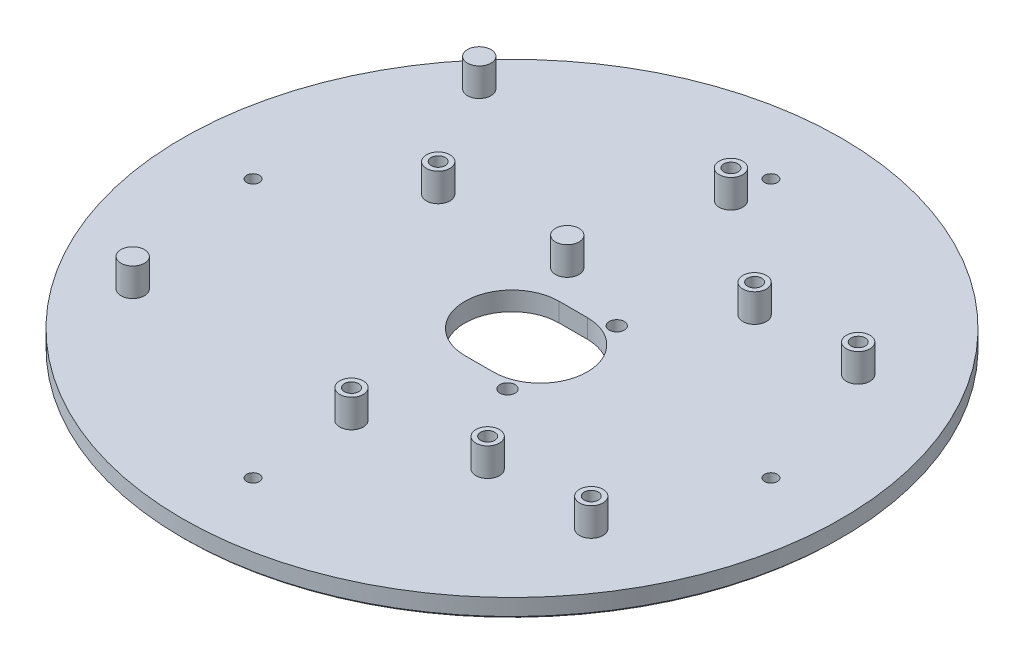
ISO-10303-21;
HEADER;
FILE_DESCRIPTION(('STEP AP214'),'2;1');
FILE_NAME('part.step','',(''),(''),'','','');
FILE_SCHEMA(('AUTOMOTIVE_DESIGN { 1 0 10303 214 1 1 1 1 }'));
ENDSEC;
DATA;
#1=APPLICATION_CONTEXT('core data for automotive mechanical design processes');
#2=APPLICATION_PROTOCOL_DEFINITION('international standard','automotive_design',2000,#1);
#3=PRODUCT_CONTEXT('',#1,'mechanical');
#4=PRODUCT('Part','Part','',(#3));
#5=PRODUCT_RELATED_PRODUCT_CATEGORY('part','',(#4));
#6=PRODUCT_DEFINITION_FORMATION('','',#4);
#7=PRODUCT_DEFINITION_CONTEXT('part definition',#1,'design');
#8=PRODUCT_DEFINITION('design','',#6,#7);
#9=PRODUCT_DEFINITION_SHAPE('','',#8);
#10=(LENGTH_UNIT() NAMED_UNIT(*) SI_UNIT(.MILLI.,.METRE.));
#11=(NAMED_UNIT(*) PLANE_ANGLE_UNIT() SI_UNIT($,.RADIAN.));
#12=(NAMED_UNIT(*) SI_UNIT($,.STERADIAN.) SOLID_ANGLE_UNIT());
#13=UNCERTAINTY_MEASURE_WITH_UNIT(LENGTH_MEASURE(1.E-05),#10,'distance_accuracy_value','');
#14=(GEOMETRIC_REPRESENTATION_CONTEXT(3) GLOBAL_UNCERTAINTY_ASSIGNED_CONTEXT((#13)) GLOBAL_UNIT_ASSIGNED_CONTEXT((#10,
#11,#12)) REPRESENTATION_CONTEXT('',''));
#15=CARTESIAN_POINT('',(0.,0.,0.));
#16=DIRECTION('',(0.,0.,1.));
#17=DIRECTION('',(1.,0.,0.));
#18=AXIS2_PLACEMENT_3D('',#15,#16,#17);
#19=CARTESIAN_POINT('',(0.,4.,0.));
#20=DIRECTION('',(0.,-1.,0.));
#21=DIRECTION('',(0.,0.,-1.));
#22=AXIS2_PLACEMENT_3D('',#19,#20,#21);
#23=CYLINDRICAL_SURFACE('',#22,70.);
#24=CARTESIAN_POINT('',(0.,0.499999999999973,0.));
#25=DIRECTION('',(0.,1.,0.));
#26=DIRECTION('',(0.,0.,1.));
#27=AXIS2_PLACEMENT_3D('',#24,#25,#26);
#28=CIRCLE('',#27,70.);
#29=CARTESIAN_POINT('',(0.,0.499999999999973,70.));
#30=VERTEX_POINT('',#29);
#31=EDGE_CURVE('E54',#30,#30,#28,.T.);
#32=ORIENTED_EDGE('',*,*,#31,.T.);
#33=EDGE_LOOP('',(#32));
#34=FACE_BOUND('',#33,.T.);
#35=CARTESIAN_POINT('',(0.,4.,0.));
#36=DIRECTION('',(0.,1.,0.));
#37=DIRECTION('',(0.,0.,1.));
#38=AXIS2_PLACEMENT_3D('',#35,#36,#37);
#39=CIRCLE('',#38,70.);
#40=CARTESIAN_POINT('',(0.,4.,70.));
#41=VERTEX_POINT('',#40);
#42=EDGE_CURVE('E93',#41,#41,#39,.T.);
#43=ORIENTED_EDGE('',*,*,#42,.F.);
#44=EDGE_LOOP('',(#43));
#45=FACE_BOUND('',#44,.T.);
#46=ADVANCED_FACE('F46',(#34,#45),#23,.T.);
#47=CARTESIAN_POINT('',(0.,4.,0.));
#48=DIRECTION('',(0.,1.,0.));
#49=DIRECTION('',(0.,0.,1.));
#50=AXIS2_PLACEMENT_3D('',#47,#48,#49);
#51=PLANE('',#50);
#52=CARTESIAN_POINT('',(10.6441872975892,4.,11.6052369361815));
#53=DIRECTION('',(0.,-1.,0.));
#54=DIRECTION('',(0.,0.,-1.));
#55=AXIS2_PLACEMENT_3D('',#52,#53,#54);
#56=CIRCLE('',#55,1.6);
#57=CARTESIAN_POINT('',(10.6441872975892,4.,10.0052369361815));
#58=VERTEX_POINT('',#57);
#59=EDGE_CURVE('E727',#58,#58,#56,.T.);
#60=ORIENTED_EDGE('',*,*,#59,.T.);
#61=EDGE_LOOP('',(#60));
#62=FACE_BOUND('',#61,.T.);
#63=CARTESIAN_POINT('',(10.6441872975892,4.,-11.6052369361815));
#64=DIRECTION('',(0.,-1.,0.));
#65=DIRECTION('',(0.,0.,-1.));
#66=AXIS2_PLACEMENT_3D('',#63,#64,#65);
#67=CIRCLE('',#66,1.6);
#68=CARTESIAN_POINT('',(10.6441872975892,4.,-13.2052369361815));
#69=VERTEX_POINT('',#68);
#70=EDGE_CURVE('E710',#69,#69,#67,.T.);
#71=ORIENTED_EDGE('',*,*,#70,.T.);
#72=EDGE_LOOP('',(#71));
#73=FACE_BOUND('',#72,.T.);
#74=CARTESIAN_POINT('',(55.,4.,0.));
#75=DIRECTION('',(0.,1.,0.));
#76=DIRECTION('',(0.,0.,1.));
#77=AXIS2_PLACEMENT_3D('',#74,#75,#76);
#78=CIRCLE('',#77,1.35);
#79=CARTESIAN_POINT('',(55.,4.,1.35));
#80=VERTEX_POINT('',#79);
#81=EDGE_CURVE('E719',#80,#80,#78,.F.);
#82=ORIENTED_EDGE('',*,*,#81,.T.);
#83=EDGE_LOOP('',(#82));
#84=FACE_BOUND('',#83,.T.);
#85=CARTESIAN_POINT('',(0.,4.,-55.));
#86=DIRECTION('',(0.,1.,0.));
#87=DIRECTION('',(0.,0.,1.));
#88=AXIS2_PLACEMENT_3D('',#85,#86,#87);
#89=CIRCLE('',#88,1.35);
#90=CARTESIAN_POINT('',(0.,4.,-53.65));
#91=VERTEX_POINT('',#90);
#92=EDGE_CURVE('E713',#91,#91,#89,.F.);
#93=ORIENTED_EDGE('',*,*,#92,.T.);
#94=EDGE_LOOP('',(#93));
#95=FACE_BOUND('',#94,.T.);
#96=CARTESIAN_POINT('',(0.,4.,55.));
#97=DIRECTION('',(0.,1.,0.));
#98=DIRECTION('',(0.,0.,1.));
#99=AXIS2_PLACEMENT_3D('',#96,#97,#98);
#100=CIRCLE('',#99,1.35);
#101=CARTESIAN_POINT('',(0.,4.,56.35));
#102=VERTEX_POINT('',#101);
#103=EDGE_CURVE('E706',#102,#102,#100,.F.);
#104=ORIENTED_EDGE('',*,*,#103,.T.);
#105=EDGE_LOOP('',(#104));
#106=FACE_BOUND('',#105,.T.);
#107=CARTESIAN_POINT('',(-55.,4.,0.));
#108=DIRECTION('',(0.,1.,0.));
#109=DIRECTION('',(0.,0.,1.));
#110=AXIS2_PLACEMENT_3D('',#107,#108,#109);
#111=CIRCLE('',#110,1.35);
#112=CARTESIAN_POINT('',(-55.,4.,1.35));
#113=VERTEX_POINT('',#112);
#114=EDGE_CURVE('E700',#113,#113,#111,.F.);
#115=ORIENTED_EDGE('',*,*,#114,.T.);
#116=EDGE_LOOP('',(#115));
#117=FACE_BOUND('',#116,.T.);
#118=CARTESIAN_POINT('',(-47.5339886149693,4.,33.0275201405061));
#119=DIRECTION('',(0.,1.,0.));
#120=DIRECTION('',(0.,0.,1.));
#121=AXIS2_PLACEMENT_3D('',#118,#119,#120);
#122=CIRCLE('',#121,2.5);
#123=CARTESIAN_POINT('',(-47.5339886149693,4.,35.5275201405061));
#124=VERTEX_POINT('',#123);
#125=EDGE_CURVE('E125',#124,#124,#122,.T.);
#126=ORIENTED_EDGE('',*,*,#125,.F.);
#127=EDGE_LOOP('',(#126));
#128=FACE_BOUND('',#127,.T.);
#129=CARTESIAN_POINT('',(-5.29337774476633,4.,-17.0303035725372));
#130=DIRECTION('',(0.,1.,0.));
#131=DIRECTION('',(0.,0.,1.));
#132=AXIS2_PLACEMENT_3D('',#129,#130,#131);
#133=CIRCLE('',#132,2.5);
#134=CARTESIAN_POINT('',(-5.29337774476633,4.,-14.5303035725372));
#135=VERTEX_POINT('',#134);
#136=EDGE_CURVE('E129',#135,#135,#133,.T.);
#137=ORIENTED_EDGE('',*,*,#136,.F.);
#138=EDGE_LOOP('',(#137));
#139=FACE_BOUND('',#138,.T.);
#140=CARTESIAN_POINT('',(-47.5339886149701,4.,-40.5718419580567));
#141=DIRECTION('',(0.,1.,0.));
#142=DIRECTION('',(0.,0.,1.));
#143=AXIS2_PLACEMENT_3D('',#140,#141,#142);
#144=CIRCLE('',#143,2.5);
#145=CARTESIAN_POINT('',(-47.5339886149701,4.,-38.0718419580567));
#146=VERTEX_POINT('',#145);
#147=EDGE_CURVE('E134',#146,#146,#144,.T.);
#148=ORIENTED_EDGE('',*,*,#147,.F.);
#149=EDGE_LOOP('',(#148));
#150=FACE_BOUND('',#149,.T.);
#151=CARTESIAN_POINT('',(-0.1529925208913,4.,33.9401713357412));
#152=DIRECTION('',(0.,1.,0.));
#153=DIRECTION('',(0.,0.,1.));
#154=AXIS2_PLACEMENT_3D('',#151,#152,#153);
#155=CIRCLE('',#154,2.5);
#156=CARTESIAN_POINT('',(-0.1529925208913,4.,36.4401713357412));
#157=VERTEX_POINT('',#156);
#158=EDGE_CURVE('E149',#157,#157,#155,.T.);
#159=ORIENTED_EDGE('',*,*,#158,.F.);
#160=EDGE_LOOP('',(#159));
#161=FACE_BOUND('',#160,.T.);
#162=CARTESIAN_POINT('',(23.2606500317656,4.,28.4285469058722));
#163=DIRECTION('',(0.,1.,0.));
#164=DIRECTION('',(0.,0.,1.));
#165=AXIS2_PLACEMENT_3D('',#162,#163,#164);
#166=CIRCLE('',#165,2.5);
#167=CARTESIAN_POINT('',(23.2606500317656,4.,30.9285469058722));
#168=VERTEX_POINT('',#167);
#169=EDGE_CURVE('E158',#168,#168,#166,.T.);
#170=ORIENTED_EDGE('',*,*,#169,.F.);
#171=EDGE_LOOP('',(#170));
#172=FACE_BOUND('',#171,.T.);
#173=CARTESIAN_POINT('',(45.2606500317656,4.,28.4285469058722));
#174=DIRECTION('',(0.,1.,0.));
#175=DIRECTION('',(0.,0.,1.));
#176=AXIS2_PLACEMENT_3D('',#173,#174,#175);
#177=CIRCLE('',#176,2.5);
#178=CARTESIAN_POINT('',(45.2606500317656,4.,30.9285469058722));
#179=VERTEX_POINT('',#178);
#180=EDGE_CURVE('E167',#179,#179,#177,.T.);
#181=ORIENTED_EDGE('',*,*,#180,.F.);
#182=EDGE_LOOP('',(#181));
#183=FACE_BOUND('',#182,.T.);
#184=CARTESIAN_POINT('',(45.2606500317656,4.,-28.2714530941278));
#185=DIRECTION('',(0.,1.,0.));
#186=DIRECTION('',(0.,0.,1.));
#187=AXIS2_PLACEMENT_3D('',#184,#185,#186);
#188=CIRCLE('',#187,2.5);
#189=CARTESIAN_POINT('',(45.2606500317656,4.,-25.7714530941278));
#190=VERTEX_POINT('',#189);
#191=EDGE_CURVE('E176',#190,#190,#188,.T.);
#192=ORIENTED_EDGE('',*,*,#191,.F.);
#193=EDGE_LOOP('',(#192));
#194=FACE_BOUND('',#193,.T.);
#195=CARTESIAN_POINT('',(23.2606500317656,4.,-28.2714530941278));
#196=DIRECTION('',(0.,1.,0.));
#197=DIRECTION('',(0.,0.,1.));
#198=AXIS2_PLACEMENT_3D('',#195,#196,#197);
#199=CIRCLE('',#198,2.5);
#200=CARTESIAN_POINT('',(23.2606500317656,4.,-25.7714530941278));
#201=VERTEX_POINT('',#200);
#202=EDGE_CURVE('E185',#201,#201,#199,.T.);
#203=ORIENTED_EDGE('',*,*,#202,.F.);
#204=EDGE_LOOP('',(#203));
#205=FACE_BOUND('',#204,.T.);
#206=CARTESIAN_POINT('',(-0.280707316952809,4.,-46.7799523134917));
#207=DIRECTION('',(0.,1.,0.));
#208=DIRECTION('',(0.,0.,1.));
#209=AXIS2_PLACEMENT_3D('',#206,#207,#208);
#210=CIRCLE('',#209,2.5);
#211=CARTESIAN_POINT('',(-0.280707316952809,4.,-44.2799523134917));
#212=VERTEX_POINT('',#211);
#213=EDGE_CURVE('E194',#212,#212,#210,.T.);
#214=ORIENTED_EDGE('',*,*,#213,.F.);
#215=EDGE_LOOP('',(#214));
#216=FACE_BOUND('',#215,.T.);
#217=CARTESIAN_POINT('',(-32.5331874532012,4.,-16.8548841204044));
#218=DIRECTION('',(0.,1.,0.));
#219=DIRECTION('',(0.,0.,1.));
#220=AXIS2_PLACEMENT_3D('',#217,#218,#219);
#221=CIRCLE('',#220,2.5);
#222=CARTESIAN_POINT('',(-32.5331874532012,4.,-14.3548841204044));
#223=VERTEX_POINT('',#222);
#224=EDGE_CURVE('E123',#223,#223,#221,.T.);
#225=ORIENTED_EDGE('',*,*,#224,.F.);
#226=EDGE_LOOP('',(#225));
#227=FACE_BOUND('',#226,.T.);
#228=CARTESIAN_POINT('',(6.,4.,0.));
#229=DIRECTION('',(0.,1.,0.));
#230=DIRECTION('',(0.,0.,1.));
#231=AXIS2_PLACEMENT_3D('',#228,#229,#230);
#232=CIRCLE('',#231,10.);
#233=CARTESIAN_POINT('',(6.,4.,-10.));
#234=VERTEX_POINT('',#233);
#235=CARTESIAN_POINT('',(6.,4.,10.));
#236=VERTEX_POINT('',#235);
#237=EDGE_CURVE('E97',#234,#236,#232,.F.);
#238=ORIENTED_EDGE('',*,*,#237,.T.);
#239=DIRECTION('',(-1.,0.,0.));
#240=VECTOR('',#239,1.);
#241=CARTESIAN_POINT('',(6.,4.,10.));
#242=LINE('',#241,#240);
#243=CARTESIAN_POINT('',(0.,4.,10.));
#244=VERTEX_POINT('',#243);
#245=EDGE_CURVE('E86',#236,#244,#242,.T.);
#246=ORIENTED_EDGE('',*,*,#245,.T.);
#247=CARTESIAN_POINT('',(0.,4.,0.));
#248=DIRECTION('',(0.,1.,0.));
#249=DIRECTION('',(0.,0.,1.));
#250=AXIS2_PLACEMENT_3D('',#247,#248,#249);
#251=CIRCLE('',#250,10.);
#252=CARTESIAN_POINT('',(0.,4.,-10.));
#253=VERTEX_POINT('',#252);
#254=EDGE_CURVE('E108',#244,#253,#251,.F.);
#255=ORIENTED_EDGE('',*,*,#254,.T.);
#256=DIRECTION('',(1.,0.,0.));
#257=VECTOR('',#256,1.);
#258=CARTESIAN_POINT('',(6.,4.,-10.));
#259=LINE('',#258,#257);
#260=EDGE_CURVE('E104',#253,#234,#259,.T.);
#261=ORIENTED_EDGE('',*,*,#260,.T.);
#262=EDGE_LOOP('',(#238,#246,#255,#261));
#263=FACE_BOUND('',#262,.T.);
#264=ORIENTED_EDGE('',*,*,#42,.T.);
#265=EDGE_LOOP('',(#264));
#266=FACE_BOUND('',#265,.T.);
#267=ADVANCED_FACE('F102',(#62,#73,#84,#95,#106,#117,#128,#139,#150,#161,#172,#183,#194,#205,
#216,#227,#263,#266),#51,.T.);
#268=CARTESIAN_POINT('',(0.,0.,0.));
#269=DIRECTION('',(0.,1.,0.));
#270=DIRECTION('',(0.,0.,1.));
#271=AXIS2_PLACEMENT_3D('',#268,#269,#270);
#272=PLANE('',#271);
#273=CARTESIAN_POINT('',(10.6441872975892,0.,11.6052369361815));
#274=DIRECTION('',(0.,-1.,0.));
#275=DIRECTION('',(0.,0.,-1.));
#276=AXIS2_PLACEMENT_3D('',#273,#274,#275);
#277=CIRCLE('',#276,1.6);
#278=CARTESIAN_POINT('',(10.6441872975892,0.,10.0052369361815));
#279=VERTEX_POINT('',#278);
#280=EDGE_CURVE('E730',#279,#279,#277,.T.);
#281=ORIENTED_EDGE('',*,*,#280,.F.);
#282=EDGE_LOOP('',(#281));
#283=FACE_BOUND('',#282,.T.);
#284=CARTESIAN_POINT('',(10.6441872975892,0.,-11.6052369361815));
#285=DIRECTION('',(0.,-1.,0.));
#286=DIRECTION('',(0.,0.,-1.));
#287=AXIS2_PLACEMENT_3D('',#284,#285,#286);
#288=CIRCLE('',#287,1.6);
#289=CARTESIAN_POINT('',(10.6441872975892,0.,-13.2052369361815));
#290=VERTEX_POINT('',#289);
#291=EDGE_CURVE('E724',#290,#290,#288,.T.);
#292=ORIENTED_EDGE('',*,*,#291,.F.);
#293=EDGE_LOOP('',(#292));
#294=FACE_BOUND('',#293,.T.);
#295=CARTESIAN_POINT('',(55.,0.,0.));
#296=DIRECTION('',(0.,-1.,0.));
#297=DIRECTION('',(0.,0.,-1.));
#298=AXIS2_PLACEMENT_3D('',#295,#296,#297);
#299=CIRCLE('',#298,1.35);
#300=CARTESIAN_POINT('',(55.,0.,-1.35));
#301=VERTEX_POINT('',#300);
#302=EDGE_CURVE('E703',#301,#301,#299,.T.);
#303=ORIENTED_EDGE('',*,*,#302,.F.);
#304=EDGE_LOOP('',(#303));
#305=FACE_BOUND('',#304,.T.);
#306=CARTESIAN_POINT('',(0.,0.,-55.));
#307=DIRECTION('',(0.,-1.,0.));
#308=DIRECTION('',(0.,0.,-1.));
#309=AXIS2_PLACEMENT_3D('',#306,#307,#308);
#310=CIRCLE('',#309,1.35);
#311=CARTESIAN_POINT('',(0.,0.,-56.35));
#312=VERTEX_POINT('',#311);
#313=EDGE_CURVE('E716',#312,#312,#310,.T.);
#314=ORIENTED_EDGE('',*,*,#313,.F.);
#315=EDGE_LOOP('',(#314));
#316=FACE_BOUND('',#315,.T.);
#317=CARTESIAN_POINT('',(0.,0.,55.));
#318=DIRECTION('',(0.,-1.,0.));
#319=DIRECTION('',(0.,0.,-1.));
#320=AXIS2_PLACEMENT_3D('',#317,#318,#319);
#321=CIRCLE('',#320,1.35);
#322=CARTESIAN_POINT('',(0.,0.,53.65));
#323=VERTEX_POINT('',#322);
#324=EDGE_CURVE('E709',#323,#323,#321,.T.);
#325=ORIENTED_EDGE('',*,*,#324,.F.);
#326=EDGE_LOOP('',(#325));
#327=FACE_BOUND('',#326,.T.);
#328=CARTESIAN_POINT('',(-55.,0.,0.));
#329=DIRECTION('',(0.,-1.,0.));
#330=DIRECTION('',(0.,0.,-1.));
#331=AXIS2_PLACEMENT_3D('',#328,#329,#330);
#332=CIRCLE('',#331,1.35);
#333=CARTESIAN_POINT('',(-55.,0.,-1.35));
#334=VERTEX_POINT('',#333);
#335=EDGE_CURVE('E696',#334,#334,#332,.T.);
#336=ORIENTED_EDGE('',*,*,#335,.F.);
#337=EDGE_LOOP('',(#336));
#338=FACE_BOUND('',#337,.T.);
#339=CARTESIAN_POINT('',(0.,0.,0.));
#340=DIRECTION('',(0.,1.,0.));
#341=DIRECTION('',(0.,0.,1.));
#342=AXIS2_PLACEMENT_3D('',#339,#340,#341);
#343=CIRCLE('',#342,69.5000000000001);
#344=CARTESIAN_POINT('',(0.,0.,69.5000000000001));
#345=VERTEX_POINT('',#344);
#346=EDGE_CURVE('E13',#345,#345,#343,.F.);
#347=ORIENTED_EDGE('',*,*,#346,.T.);
#348=EDGE_LOOP('',(#347));
#349=FACE_BOUND('',#348,.T.);
#350=CARTESIAN_POINT('',(-0.280707316952809,0.,-46.7799523134917));
#351=DIRECTION('',(0.,1.,0.));
#352=DIRECTION('',(0.,0.,1.));
#353=AXIS2_PLACEMENT_3D('',#350,#351,#352);
#354=CIRCLE('',#353,1.41008319207524);
#355=CARTESIAN_POINT('',(-0.280707316952809,0.,-45.3698691214165));
#356=VERTEX_POINT('',#355);
#357=EDGE_CURVE('E663',#356,#356,#354,.T.);
#358=ORIENTED_EDGE('',*,*,#357,.T.);
#359=EDGE_LOOP('',(#358));
#360=FACE_BOUND('',#359,.T.);
#361=CARTESIAN_POINT('',(-0.1529925208913,0.,33.9401713357412));
#362=DIRECTION('',(0.,1.,0.));
#363=DIRECTION('',(0.,0.,1.));
#364=AXIS2_PLACEMENT_3D('',#361,#362,#363);
#365=CIRCLE('',#364,1.5);
#366=CARTESIAN_POINT('',(-0.1529925208913,0.,35.4401713357412));
#367=VERTEX_POINT('',#366);
#368=EDGE_CURVE('E667',#367,#367,#365,.T.);
#369=ORIENTED_EDGE('',*,*,#368,.T.);
#370=EDGE_LOOP('',(#369));
#371=FACE_BOUND('',#370,.T.);
#372=CARTESIAN_POINT('',(23.2606500317656,0.,28.4285469058722));
#373=DIRECTION('',(0.,1.,0.));
#374=DIRECTION('',(0.,0.,1.));
#375=AXIS2_PLACEMENT_3D('',#372,#373,#374);
#376=CIRCLE('',#375,1.5);
#377=CARTESIAN_POINT('',(23.2606500317656,0.,29.9285469058722));
#378=VERTEX_POINT('',#377);
#379=EDGE_CURVE('E671',#378,#378,#376,.T.);
#380=ORIENTED_EDGE('',*,*,#379,.T.);
#381=EDGE_LOOP('',(#380));
#382=FACE_BOUND('',#381,.T.);
#383=CARTESIAN_POINT('',(45.2606500317656,0.,28.4285469058722));
#384=DIRECTION('',(0.,1.,0.));
#385=DIRECTION('',(0.,0.,1.));
#386=AXIS2_PLACEMENT_3D('',#383,#384,#385);
#387=CIRCLE('',#386,1.50000000000001);
#388=CARTESIAN_POINT('',(45.2606500317656,0.,29.9285469058722));
#389=VERTEX_POINT('',#388);
#390=EDGE_CURVE('E675',#389,#389,#387,.T.);
#391=ORIENTED_EDGE('',*,*,#390,.T.);
#392=EDGE_LOOP('',(#391));
#393=FACE_BOUND('',#392,.T.);
#394=CARTESIAN_POINT('',(45.2606500317656,0.,-28.2714530941278));
#395=DIRECTION('',(0.,1.,0.));
#396=DIRECTION('',(0.,0.,1.));
#397=AXIS2_PLACEMENT_3D('',#394,#395,#396);
#398=CIRCLE('',#397,1.5);
#399=CARTESIAN_POINT('',(45.2606500317656,0.,-26.7714530941278));
#400=VERTEX_POINT('',#399);
#401=EDGE_CURVE('E679',#400,#400,#398,.T.);
#402=ORIENTED_EDGE('',*,*,#401,.T.);
#403=EDGE_LOOP('',(#402));
#404=FACE_BOUND('',#403,.T.);
#405=CARTESIAN_POINT('',(23.2606500317656,0.,-28.2714530941278));
#406=DIRECTION('',(0.,1.,0.));
#407=DIRECTION('',(0.,0.,1.));
#408=AXIS2_PLACEMENT_3D('',#405,#406,#407);
#409=CIRCLE('',#408,1.5);
#410=CARTESIAN_POINT('',(23.2606500317656,0.,-26.7714530941278));
#411=VERTEX_POINT('',#410);
#412=EDGE_CURVE('E683',#411,#411,#409,.T.);
#413=ORIENTED_EDGE('',*,*,#412,.T.);
#414=EDGE_LOOP('',(#413));
#415=FACE_BOUND('',#414,.T.);
#416=CARTESIAN_POINT('',(-32.5331874532012,0.,-16.8548841204044));
#417=DIRECTION('',(0.,1.,0.));
#418=DIRECTION('',(0.,0.,1.));
#419=AXIS2_PLACEMENT_3D('',#416,#417,#418);
#420=CIRCLE('',#419,1.5);
#421=CARTESIAN_POINT('',(-32.5331874532012,0.,-15.3548841204044));
#422=VERTEX_POINT('',#421);
#423=EDGE_CURVE('E686',#422,#422,#420,.T.);
#424=ORIENTED_EDGE('',*,*,#423,.T.);
#425=EDGE_LOOP('',(#424));
#426=FACE_BOUND('',#425,.T.);
#427=DIRECTION('',(-1.,0.,0.));
#428=VECTOR('',#427,1.);
#429=CARTESIAN_POINT('',(6.,0.,10.));
#430=LINE('',#429,#428);
#431=CARTESIAN_POINT('',(6.,0.,10.));
#432=VERTEX_POINT('',#431);
#433=CARTESIAN_POINT('',(0.,0.,10.));
#434=VERTEX_POINT('',#433);
#435=EDGE_CURVE('E106',#432,#434,#430,.T.);
#436=ORIENTED_EDGE('',*,*,#435,.F.);
#437=CARTESIAN_POINT('',(6.,0.,0.));
#438=DIRECTION('',(0.,-1.,0.));
#439=DIRECTION('',(0.,0.,-1.));
#440=AXIS2_PLACEMENT_3D('',#437,#438,#439);
#441=CIRCLE('',#440,10.);
#442=CARTESIAN_POINT('',(6.,0.,-10.));
#443=VERTEX_POINT('',#442);
#444=EDGE_CURVE('E69',#443,#432,#441,.T.);
#445=ORIENTED_EDGE('',*,*,#444,.F.);
#446=DIRECTION('',(1.,0.,0.));
#447=VECTOR('',#446,1.);
#448=CARTESIAN_POINT('',(6.,0.,-10.));
#449=LINE('',#448,#447);
#450=CARTESIAN_POINT('',(0.,0.,-10.));
#451=VERTEX_POINT('',#450);
#452=EDGE_CURVE('E99',#451,#443,#449,.T.);
#453=ORIENTED_EDGE('',*,*,#452,.F.);
#454=CARTESIAN_POINT('',(0.,0.,0.));
#455=DIRECTION('',(0.,-1.,0.));
#456=DIRECTION('',(0.,0.,-1.));
#457=AXIS2_PLACEMENT_3D('',#454,#455,#456);
#458=CIRCLE('',#457,10.);
#459=EDGE_CURVE('E113',#434,#451,#458,.T.);
#460=ORIENTED_EDGE('',*,*,#459,.F.);
#461=EDGE_LOOP('',(#436,#445,#453,#460));
#462=FACE_BOUND('',#461,.T.);
#463=ADVANCED_FACE('F220',(#283,#294,#305,#316,#327,#338,#349,#360,#371,#382,#393,#404,#415,
#426,#462),#272,.F.);
#464=CARTESIAN_POINT('',(6.,4.001,0.));
#465=DIRECTION('',(0.,-1.,0.));
#466=DIRECTION('',(0.,0.,-1.));
#467=AXIS2_PLACEMENT_3D('',#464,#465,#466);
#468=CYLINDRICAL_SURFACE('',#467,10.);
#469=DIRECTION('',(0.,-1.,0.));
#470=VECTOR('',#469,1.);
#471=CARTESIAN_POINT('',(6.,4.001,-10.));
#472=LINE('',#471,#470);
#473=EDGE_CURVE('E94',#234,#443,#472,.T.);
#474=ORIENTED_EDGE('',*,*,#473,.T.);
#475=ORIENTED_EDGE('',*,*,#444,.T.);
#476=DIRECTION('',(0.,-1.,0.));
#477=VECTOR('',#476,1.);
#478=CARTESIAN_POINT('',(6.,4.001,10.));
#479=LINE('',#478,#477);
#480=EDGE_CURVE('E88',#236,#432,#479,.T.);
#481=ORIENTED_EDGE('',*,*,#480,.F.);
#482=ORIENTED_EDGE('',*,*,#237,.F.);
#483=EDGE_LOOP('',(#474,#475,#481,#482));
#484=FACE_BOUND('',#483,.T.);
#485=ADVANCED_FACE('F96',(#484),#468,.F.);
#486=CARTESIAN_POINT('',(6.,4.001,-10.));
#487=DIRECTION('',(0.,0.,-1.));
#488=DIRECTION('',(-1.,0.,0.));
#489=AXIS2_PLACEMENT_3D('',#486,#487,#488);
#490=PLANE('',#489);
#491=DIRECTION('',(0.,-1.,0.));
#492=VECTOR('',#491,1.);
#493=CARTESIAN_POINT('',(0.,4.001,-10.));
#494=LINE('',#493,#492);
#495=EDGE_CURVE('E119',#253,#451,#494,.T.);
#496=ORIENTED_EDGE('',*,*,#495,.T.);
#497=ORIENTED_EDGE('',*,*,#452,.T.);
#498=ORIENTED_EDGE('',*,*,#473,.F.);
#499=ORIENTED_EDGE('',*,*,#260,.F.);
#500=EDGE_LOOP('',(#496,#497,#498,#499));
#501=FACE_BOUND('',#500,.T.);
#502=ADVANCED_FACE('F218',(#501),#490,.F.);
#503=CARTESIAN_POINT('',(0.,4.001,0.));
#504=DIRECTION('',(0.,-1.,0.));
#505=DIRECTION('',(0.,0.,-1.));
#506=AXIS2_PLACEMENT_3D('',#503,#504,#505);
#507=CYLINDRICAL_SURFACE('',#506,10.);
#508=DIRECTION('',(0.,-1.,0.));
#509=VECTOR('',#508,1.);
#510=CARTESIAN_POINT('',(0.,4.001,10.));
#511=LINE('',#510,#509);
#512=EDGE_CURVE('E61',#244,#434,#511,.T.);
#513=ORIENTED_EDGE('',*,*,#512,.T.);
#514=ORIENTED_EDGE('',*,*,#459,.T.);
#515=ORIENTED_EDGE('',*,*,#495,.F.);
#516=ORIENTED_EDGE('',*,*,#254,.F.);
#517=EDGE_LOOP('',(#513,#514,#515,#516));
#518=FACE_BOUND('',#517,.T.);
#519=ADVANCED_FACE('F214',(#518),#507,.F.);
#520=CARTESIAN_POINT('',(6.,4.001,10.));
#521=DIRECTION('',(0.,0.,1.));
#522=DIRECTION('',(1.,0.,0.));
#523=AXIS2_PLACEMENT_3D('',#520,#521,#522);
#524=PLANE('',#523);
#525=ORIENTED_EDGE('',*,*,#480,.T.);
#526=ORIENTED_EDGE('',*,*,#435,.T.);
#527=ORIENTED_EDGE('',*,*,#512,.F.);
#528=ORIENTED_EDGE('',*,*,#245,.F.);
#529=EDGE_LOOP('',(#525,#526,#527,#528));
#530=FACE_BOUND('',#529,.T.);
#531=ADVANCED_FACE('F87',(#530),#524,.F.);
#532=CARTESIAN_POINT('',(-32.5331874532012,-7.07106781186549,-16.8548841204044));
#533=DIRECTION('',(0.,1.,0.));
#534=DIRECTION('',(0.,0.,1.));
#535=AXIS2_PLACEMENT_3D('',#532,#533,#534);
#536=CYLINDRICAL_SURFACE('',#535,2.5);
#537=ORIENTED_EDGE('',*,*,#224,.T.);
#538=EDGE_LOOP('',(#537));
#539=FACE_BOUND('',#538,.T.);
#540=CARTESIAN_POINT('',(-32.5331874532012,10.,-16.8548841204044));
#541=DIRECTION('',(0.,1.,0.));
#542=DIRECTION('',(0.,0.,1.));
#543=AXIS2_PLACEMENT_3D('',#540,#541,#542);
#544=CIRCLE('',#543,2.5);
#545=CARTESIAN_POINT('',(-32.5331874532012,10.,-14.3548841204044));
#546=VERTEX_POINT('',#545);
#547=EDGE_CURVE('E208',#546,#546,#544,.T.);
#548=ORIENTED_EDGE('',*,*,#547,.F.);
#549=EDGE_LOOP('',(#548));
#550=FACE_BOUND('',#549,.T.);
#551=ADVANCED_FACE('F403',(#539,#550),#536,.T.);
#552=CARTESIAN_POINT('',(-32.5331874532012,-7.07106781186549,-16.8548841204044));
#553=DIRECTION('',(0.,1.,0.));
#554=DIRECTION('',(0.,0.,1.));
#555=AXIS2_PLACEMENT_3D('',#552,#553,#554);
#556=CYLINDRICAL_SURFACE('',#555,1.5);
#557=CARTESIAN_POINT('',(-32.5331874532012,10.,-16.8548841204044));
#558=DIRECTION('',(0.,1.,0.));
#559=DIRECTION('',(0.,0.,1.));
#560=AXIS2_PLACEMENT_3D('',#557,#558,#559);
#561=CIRCLE('',#560,1.5);
#562=CARTESIAN_POINT('',(-32.5331874532012,10.,-15.3548841204044));
#563=VERTEX_POINT('',#562);
#564=EDGE_CURVE('E203',#563,#563,#561,.T.);
#565=ORIENTED_EDGE('',*,*,#564,.T.);
#566=EDGE_LOOP('',(#565));
#567=FACE_BOUND('',#566,.T.);
#568=ORIENTED_EDGE('',*,*,#423,.F.);
#569=EDGE_LOOP('',(#568));
#570=FACE_BOUND('',#569,.T.);
#571=ADVANCED_FACE('F399',(#567,#570),#556,.F.);
#572=CARTESIAN_POINT('',(-32.5331874532012,10.,-16.8548841204044));
#573=DIRECTION('',(0.,1.,0.));
#574=DIRECTION('',(0.,0.,1.));
#575=AXIS2_PLACEMENT_3D('',#572,#573,#574);
#576=PLANE('',#575);
#577=ORIENTED_EDGE('',*,*,#547,.T.);
#578=EDGE_LOOP('',(#577));
#579=FACE_BOUND('',#578,.T.);
#580=ORIENTED_EDGE('',*,*,#564,.F.);
#581=EDGE_LOOP('',(#580));
#582=FACE_BOUND('',#581,.T.);
#583=ADVANCED_FACE('F395',(#579,#582),#576,.T.);
#584=CARTESIAN_POINT('',(-0.280707316952809,-7.07106781186549,-46.7799523134917));
#585=DIRECTION('',(0.,1.,0.));
#586=DIRECTION('',(0.,0.,1.));
#587=AXIS2_PLACEMENT_3D('',#584,#585,#586);
#588=CYLINDRICAL_SURFACE('',#587,2.5);
#589=ORIENTED_EDGE('',*,*,#213,.T.);
#590=EDGE_LOOP('',(#589));
#591=FACE_BOUND('',#590,.T.);
#592=CARTESIAN_POINT('',(-0.280707316952809,10.,-46.7799523134917));
#593=DIRECTION('',(0.,1.,0.));
#594=DIRECTION('',(0.,0.,1.));
#595=AXIS2_PLACEMENT_3D('',#592,#593,#594);
#596=CIRCLE('',#595,2.5);
#597=CARTESIAN_POINT('',(-0.280707316952809,10.,-44.2799523134917));
#598=VERTEX_POINT('',#597);
#599=EDGE_CURVE('E197',#598,#598,#596,.T.);
#600=ORIENTED_EDGE('',*,*,#599,.F.);
#601=EDGE_LOOP('',(#600));
#602=FACE_BOUND('',#601,.T.);
#603=ADVANCED_FACE('F391',(#591,#602),#588,.T.);
#604=CARTESIAN_POINT('',(-0.280707316952809,-7.07106781186549,-46.7799523134917));
#605=DIRECTION('',(0.,1.,0.));
#606=DIRECTION('',(0.,0.,1.));
#607=AXIS2_PLACEMENT_3D('',#604,#605,#606);
#608=CYLINDRICAL_SURFACE('',#607,1.5);
#609=CARTESIAN_POINT('',(-0.280707316952809,4.,-46.7799523134917));
#610=DIRECTION('',(0.,1.,0.));
#611=DIRECTION('',(0.,0.,1.));
#612=AXIS2_PLACEMENT_3D('',#609,#610,#611);
#613=CIRCLE('',#612,1.5);
#614=CARTESIAN_POINT('',(-0.280707316952809,4.,-45.2799523134917));
#615=VERTEX_POINT('',#614);
#616=EDGE_CURVE('E200',#615,#615,#613,.T.);
#617=ORIENTED_EDGE('',*,*,#616,.F.);
#618=EDGE_LOOP('',(#617));
#619=FACE_BOUND('',#618,.T.);
#620=CARTESIAN_POINT('',(-0.280707316952809,10.,-46.7799523134917));
#621=DIRECTION('',(0.,1.,0.));
#622=DIRECTION('',(0.,0.,1.));
#623=AXIS2_PLACEMENT_3D('',#620,#621,#622);
#624=CIRCLE('',#623,1.5);
#625=CARTESIAN_POINT('',(-0.280707316952809,10.,-45.2799523134917));
#626=VERTEX_POINT('',#625);
#627=EDGE_CURVE('E191',#626,#626,#624,.T.);
#628=ORIENTED_EDGE('',*,*,#627,.T.);
#629=EDGE_LOOP('',(#628));
#630=FACE_BOUND('',#629,.T.);
#631=ADVANCED_FACE('F387',(#619,#630),#608,.F.);
#632=CARTESIAN_POINT('',(-0.280707316952809,10.,-46.7799523134917));
#633=DIRECTION('',(0.,1.,0.));
#634=DIRECTION('',(0.,0.,1.));
#635=AXIS2_PLACEMENT_3D('',#632,#633,#634);
#636=PLANE('',#635);
#637=ORIENTED_EDGE('',*,*,#599,.T.);
#638=EDGE_LOOP('',(#637));
#639=FACE_BOUND('',#638,.T.);
#640=ORIENTED_EDGE('',*,*,#627,.F.);
#641=EDGE_LOOP('',(#640));
#642=FACE_BOUND('',#641,.T.);
#643=ADVANCED_FACE('F384',(#639,#642),#636,.T.);
#644=CARTESIAN_POINT('',(-0.280707316952809,4.,-46.7799523134917));
#645=DIRECTION('',(0.,1.,0.));
#646=DIRECTION('',(0.,0.,1.));
#647=AXIS2_PLACEMENT_3D('',#644,#645,#646);
#648=CIRCLE('',#647,1.41008319207524);
#649=CARTESIAN_POINT('',(-0.280707316952809,4.,-45.3698691214165));
#650=VERTEX_POINT('',#649);
#651=EDGE_CURVE('E693',#650,#650,#648,.T.);
#652=ORIENTED_EDGE('',*,*,#651,.F.);
#653=EDGE_LOOP('',(#652));
#654=FACE_BOUND('',#653,.T.);
#655=ORIENTED_EDGE('',*,*,#616,.T.);
#656=EDGE_LOOP('',(#655));
#657=FACE_BOUND('',#656,.T.);
#658=ADVANCED_FACE('F231',(#654,#657),#51,.T.);
#659=CARTESIAN_POINT('',(23.2606500317656,-7.07106781186549,-28.2714530941278));
#660=DIRECTION('',(0.,1.,0.));
#661=DIRECTION('',(0.,0.,1.));
#662=AXIS2_PLACEMENT_3D('',#659,#660,#661);
#663=CYLINDRICAL_SURFACE('',#662,2.5);
#664=ORIENTED_EDGE('',*,*,#202,.T.);
#665=EDGE_LOOP('',(#664));
#666=FACE_BOUND('',#665,.T.);
#667=CARTESIAN_POINT('',(23.2606500317656,10.,-28.2714530941278));
#668=DIRECTION('',(0.,1.,0.));
#669=DIRECTION('',(0.,0.,1.));
#670=AXIS2_PLACEMENT_3D('',#667,#668,#669);
#671=CIRCLE('',#670,2.5);
#672=CARTESIAN_POINT('',(23.2606500317656,10.,-25.7714530941278));
#673=VERTEX_POINT('',#672);
#674=EDGE_CURVE('E188',#673,#673,#671,.T.);
#675=ORIENTED_EDGE('',*,*,#674,.F.);
#676=EDGE_LOOP('',(#675));
#677=FACE_BOUND('',#676,.T.);
#678=ADVANCED_FACE('F379',(#666,#677),#663,.T.);
#679=CARTESIAN_POINT('',(23.2606500317656,-7.07106781186549,-28.2714530941278));
#680=DIRECTION('',(0.,1.,0.));
#681=DIRECTION('',(0.,0.,1.));
#682=AXIS2_PLACEMENT_3D('',#679,#680,#681);
#683=CYLINDRICAL_SURFACE('',#682,1.5);
#684=CARTESIAN_POINT('',(23.2606500317656,10.,-28.2714530941278));
#685=DIRECTION('',(0.,1.,0.));
#686=DIRECTION('',(0.,0.,1.));
#687=AXIS2_PLACEMENT_3D('',#684,#685,#686);
#688=CIRCLE('',#687,1.5);
#689=CARTESIAN_POINT('',(23.2606500317656,10.,-26.7714530941278));
#690=VERTEX_POINT('',#689);
#691=EDGE_CURVE('E182',#690,#690,#688,.T.);
#692=ORIENTED_EDGE('',*,*,#691,.T.);
#693=EDGE_LOOP('',(#692));
#694=FACE_BOUND('',#693,.T.);
#695=ORIENTED_EDGE('',*,*,#412,.F.);
#696=EDGE_LOOP('',(#695));
#697=FACE_BOUND('',#696,.T.);
#698=ADVANCED_FACE('F375',(#694,#697),#683,.F.);
#699=CARTESIAN_POINT('',(23.2606500317656,10.,-28.2714530941278));
#700=DIRECTION('',(0.,1.,0.));
#701=DIRECTION('',(0.,0.,1.));
#702=AXIS2_PLACEMENT_3D('',#699,#700,#701);
#703=PLANE('',#702);
#704=ORIENTED_EDGE('',*,*,#674,.T.);
#705=EDGE_LOOP('',(#704));
#706=FACE_BOUND('',#705,.T.);
#707=ORIENTED_EDGE('',*,*,#691,.F.);
#708=EDGE_LOOP('',(#707));
#709=FACE_BOUND('',#708,.T.);
#710=ADVANCED_FACE('F371',(#706,#709),#703,.T.);
#711=CARTESIAN_POINT('',(45.2606500317656,-7.07106781186549,-28.2714530941278));
#712=DIRECTION('',(0.,1.,0.));
#713=DIRECTION('',(0.,0.,1.));
#714=AXIS2_PLACEMENT_3D('',#711,#712,#713);
#715=CYLINDRICAL_SURFACE('',#714,2.5);
#716=ORIENTED_EDGE('',*,*,#191,.T.);
#717=EDGE_LOOP('',(#716));
#718=FACE_BOUND('',#717,.T.);
#719=CARTESIAN_POINT('',(45.2606500317656,10.,-28.2714530941278));
#720=DIRECTION('',(0.,1.,0.));
#721=DIRECTION('',(0.,0.,1.));
#722=AXIS2_PLACEMENT_3D('',#719,#720,#721);
#723=CIRCLE('',#722,2.5);
#724=CARTESIAN_POINT('',(45.2606500317656,10.,-25.7714530941278));
#725=VERTEX_POINT('',#724);
#726=EDGE_CURVE('E179',#725,#725,#723,.T.);
#727=ORIENTED_EDGE('',*,*,#726,.F.);
#728=EDGE_LOOP('',(#727));
#729=FACE_BOUND('',#728,.T.);
#730=ADVANCED_FACE('F367',(#718,#729),#715,.T.);
#731=CARTESIAN_POINT('',(45.2606500317656,-7.07106781186549,-28.2714530941278));
#732=DIRECTION('',(0.,1.,0.));
#733=DIRECTION('',(0.,0.,1.));
#734=AXIS2_PLACEMENT_3D('',#731,#732,#733);
#735=CYLINDRICAL_SURFACE('',#734,1.5);
#736=CARTESIAN_POINT('',(45.2606500317656,10.,-28.2714530941278));
#737=DIRECTION('',(0.,1.,0.));
#738=DIRECTION('',(0.,0.,1.));
#739=AXIS2_PLACEMENT_3D('',#736,#737,#738);
#740=CIRCLE('',#739,1.5);
#741=CARTESIAN_POINT('',(45.2606500317656,10.,-26.7714530941278));
#742=VERTEX_POINT('',#741);
#743=EDGE_CURVE('E173',#742,#742,#740,.T.);
#744=ORIENTED_EDGE('',*,*,#743,.T.);
#745=EDGE_LOOP('',(#744));
#746=FACE_BOUND('',#745,.T.);
#747=ORIENTED_EDGE('',*,*,#401,.F.);
#748=EDGE_LOOP('',(#747));
#749=FACE_BOUND('',#748,.T.);
#750=ADVANCED_FACE('F363',(#746,#749),#735,.F.);
#751=CARTESIAN_POINT('',(45.2606500317656,10.,-28.2714530941278));
#752=DIRECTION('',(0.,1.,0.));
#753=DIRECTION('',(0.,0.,1.));
#754=AXIS2_PLACEMENT_3D('',#751,#752,#753);
#755=PLANE('',#754);
#756=ORIENTED_EDGE('',*,*,#726,.T.);
#757=EDGE_LOOP('',(#756));
#758=FACE_BOUND('',#757,.T.);
#759=ORIENTED_EDGE('',*,*,#743,.F.);
#760=EDGE_LOOP('',(#759));
#761=FACE_BOUND('',#760,.T.);
#762=ADVANCED_FACE('F359',(#758,#761),#755,.T.);
#763=CARTESIAN_POINT('',(45.2606500317656,-7.07106781186549,28.4285469058722));
#764=DIRECTION('',(0.,1.,0.));
#765=DIRECTION('',(0.,0.,1.));
#766=AXIS2_PLACEMENT_3D('',#763,#764,#765);
#767=CYLINDRICAL_SURFACE('',#766,2.5);
#768=ORIENTED_EDGE('',*,*,#180,.T.);
#769=EDGE_LOOP('',(#768));
#770=FACE_BOUND('',#769,.T.);
#771=CARTESIAN_POINT('',(45.2606500317656,10.,28.4285469058722));
#772=DIRECTION('',(0.,1.,0.));
#773=DIRECTION('',(0.,0.,1.));
#774=AXIS2_PLACEMENT_3D('',#771,#772,#773);
#775=CIRCLE('',#774,2.5);
#776=CARTESIAN_POINT('',(45.2606500317656,10.,30.9285469058722));
#777=VERTEX_POINT('',#776);
#778=EDGE_CURVE('E170',#777,#777,#775,.T.);
#779=ORIENTED_EDGE('',*,*,#778,.F.);
#780=EDGE_LOOP('',(#779));
#781=FACE_BOUND('',#780,.T.);
#782=ADVANCED_FACE('F355',(#770,#781),#767,.T.);
#783=CARTESIAN_POINT('',(45.2606500317656,-7.07106781186549,28.4285469058722));
#784=DIRECTION('',(0.,1.,0.));
#785=DIRECTION('',(0.,0.,1.));
#786=AXIS2_PLACEMENT_3D('',#783,#784,#785);
#787=CYLINDRICAL_SURFACE('',#786,1.5);
#788=CARTESIAN_POINT('',(45.2606500317656,10.,28.4285469058722));
#789=DIRECTION('',(0.,1.,0.));
#790=DIRECTION('',(0.,0.,1.));
#791=AXIS2_PLACEMENT_3D('',#788,#789,#790);
#792=CIRCLE('',#791,1.5);
#793=CARTESIAN_POINT('',(45.2606500317656,10.,29.9285469058722));
#794=VERTEX_POINT('',#793);
#795=EDGE_CURVE('E164',#794,#794,#792,.T.);
#796=ORIENTED_EDGE('',*,*,#795,.T.);
#797=EDGE_LOOP('',(#796));
#798=FACE_BOUND('',#797,.T.);
#799=ORIENTED_EDGE('',*,*,#390,.F.);
#800=EDGE_LOOP('',(#799));
#801=FACE_BOUND('',#800,.T.);
#802=ADVANCED_FACE('F351',(#798,#801),#787,.F.);
#803=CARTESIAN_POINT('',(45.2606500317656,10.,28.4285469058722));
#804=DIRECTION('',(0.,1.,0.));
#805=DIRECTION('',(0.,0.,1.));
#806=AXIS2_PLACEMENT_3D('',#803,#804,#805);
#807=PLANE('',#806);
#808=ORIENTED_EDGE('',*,*,#778,.T.);
#809=EDGE_LOOP('',(#808));
#810=FACE_BOUND('',#809,.T.);
#811=ORIENTED_EDGE('',*,*,#795,.F.);
#812=EDGE_LOOP('',(#811));
#813=FACE_BOUND('',#812,.T.);
#814=ADVANCED_FACE('F347',(#810,#813),#807,.T.);
#815=CARTESIAN_POINT('',(23.2606500317656,-7.07106781186549,28.4285469058722));
#816=DIRECTION('',(0.,1.,0.));
#817=DIRECTION('',(0.,0.,1.));
#818=AXIS2_PLACEMENT_3D('',#815,#816,#817);
#819=CYLINDRICAL_SURFACE('',#818,2.5);
#820=ORIENTED_EDGE('',*,*,#169,.T.);
#821=EDGE_LOOP('',(#820));
#822=FACE_BOUND('',#821,.T.);
#823=CARTESIAN_POINT('',(23.2606500317656,10.,28.4285469058722));
#824=DIRECTION('',(0.,1.,0.));
#825=DIRECTION('',(0.,0.,1.));
#826=AXIS2_PLACEMENT_3D('',#823,#824,#825);
#827=CIRCLE('',#826,2.5);
#828=CARTESIAN_POINT('',(23.2606500317656,10.,30.9285469058722));
#829=VERTEX_POINT('',#828);
#830=EDGE_CURVE('E161',#829,#829,#827,.T.);
#831=ORIENTED_EDGE('',*,*,#830,.F.);
#832=EDGE_LOOP('',(#831));
#833=FACE_BOUND('',#832,.T.);
#834=ADVANCED_FACE('F343',(#822,#833),#819,.T.);
#835=CARTESIAN_POINT('',(23.2606500317656,-7.07106781186549,28.4285469058722));
#836=DIRECTION('',(0.,1.,0.));
#837=DIRECTION('',(0.,0.,1.));
#838=AXIS2_PLACEMENT_3D('',#835,#836,#837);
#839=CYLINDRICAL_SURFACE('',#838,1.5);
#840=CARTESIAN_POINT('',(23.2606500317656,10.,28.4285469058722));
#841=DIRECTION('',(0.,1.,0.));
#842=DIRECTION('',(0.,0.,1.));
#843=AXIS2_PLACEMENT_3D('',#840,#841,#842);
#844=CIRCLE('',#843,1.5);
#845=CARTESIAN_POINT('',(23.2606500317656,10.,29.9285469058722));
#846=VERTEX_POINT('',#845);
#847=EDGE_CURVE('E155',#846,#846,#844,.T.);
#848=ORIENTED_EDGE('',*,*,#847,.T.);
#849=EDGE_LOOP('',(#848));
#850=FACE_BOUND('',#849,.T.);
#851=ORIENTED_EDGE('',*,*,#379,.F.);
#852=EDGE_LOOP('',(#851));
#853=FACE_BOUND('',#852,.T.);
#854=ADVANCED_FACE('F339',(#850,#853),#839,.F.);
#855=CARTESIAN_POINT('',(23.2606500317656,10.,28.4285469058722));
#856=DIRECTION('',(0.,1.,0.));
#857=DIRECTION('',(0.,0.,1.));
#858=AXIS2_PLACEMENT_3D('',#855,#856,#857);
#859=PLANE('',#858);
#860=ORIENTED_EDGE('',*,*,#830,.T.);
#861=EDGE_LOOP('',(#860));
#862=FACE_BOUND('',#861,.T.);
#863=ORIENTED_EDGE('',*,*,#847,.F.);
#864=EDGE_LOOP('',(#863));
#865=FACE_BOUND('',#864,.T.);
#866=ADVANCED_FACE('F335',(#862,#865),#859,.T.);
#867=CARTESIAN_POINT('',(-0.1529925208913,-7.07106781186549,33.9401713357412));
#868=DIRECTION('',(0.,1.,0.));
#869=DIRECTION('',(0.,0.,1.));
#870=AXIS2_PLACEMENT_3D('',#867,#868,#869);
#871=CYLINDRICAL_SURFACE('',#870,2.5);
#872=ORIENTED_EDGE('',*,*,#158,.T.);
#873=EDGE_LOOP('',(#872));
#874=FACE_BOUND('',#873,.T.);
#875=CARTESIAN_POINT('',(-0.1529925208913,10.,33.9401713357412));
#876=DIRECTION('',(0.,1.,0.));
#877=DIRECTION('',(0.,0.,1.));
#878=AXIS2_PLACEMENT_3D('',#875,#876,#877);
#879=CIRCLE('',#878,2.5);
#880=CARTESIAN_POINT('',(-0.1529925208913,10.,36.4401713357412));
#881=VERTEX_POINT('',#880);
#882=EDGE_CURVE('E152',#881,#881,#879,.T.);
#883=ORIENTED_EDGE('',*,*,#882,.F.);
#884=EDGE_LOOP('',(#883));
#885=FACE_BOUND('',#884,.T.);
#886=ADVANCED_FACE('F331',(#874,#885),#871,.T.);
#887=CARTESIAN_POINT('',(-0.1529925208913,-7.07106781186549,33.9401713357412));
#888=DIRECTION('',(0.,1.,0.));
#889=DIRECTION('',(0.,0.,1.));
#890=AXIS2_PLACEMENT_3D('',#887,#888,#889);
#891=CYLINDRICAL_SURFACE('',#890,1.5);
#892=CARTESIAN_POINT('',(-0.1529925208913,10.,33.9401713357412));
#893=DIRECTION('',(0.,1.,0.));
#894=DIRECTION('',(0.,0.,1.));
#895=AXIS2_PLACEMENT_3D('',#892,#893,#894);
#896=CIRCLE('',#895,1.5);
#897=CARTESIAN_POINT('',(-0.1529925208913,10.,35.4401713357412));
#898=VERTEX_POINT('',#897);
#899=EDGE_CURVE('E146',#898,#898,#896,.T.);
#900=ORIENTED_EDGE('',*,*,#899,.T.);
#901=EDGE_LOOP('',(#900));
#902=FACE_BOUND('',#901,.T.);
#903=ORIENTED_EDGE('',*,*,#368,.F.);
#904=EDGE_LOOP('',(#903));
#905=FACE_BOUND('',#904,.T.);
#906=ADVANCED_FACE('F327',(#902,#905),#891,.F.);
#907=CARTESIAN_POINT('',(-0.1529925208913,10.,33.9401713357412));
#908=DIRECTION('',(0.,1.,0.));
#909=DIRECTION('',(0.,0.,1.));
#910=AXIS2_PLACEMENT_3D('',#907,#908,#909);
#911=PLANE('',#910);
#912=ORIENTED_EDGE('',*,*,#882,.T.);
#913=EDGE_LOOP('',(#912));
#914=FACE_BOUND('',#913,.T.);
#915=ORIENTED_EDGE('',*,*,#899,.F.);
#916=EDGE_LOOP('',(#915));
#917=FACE_BOUND('',#916,.T.);
#918=ADVANCED_FACE('F323',(#914,#917),#911,.T.);
#919=CARTESIAN_POINT('',(-47.5339886149701,-7.07106781186549,-40.5718419580567));
#920=DIRECTION('',(0.,1.,0.));
#921=DIRECTION('',(0.,0.,1.));
#922=AXIS2_PLACEMENT_3D('',#919,#920,#921);
#923=CYLINDRICAL_SURFACE('',#922,2.5);
#924=ORIENTED_EDGE('',*,*,#147,.T.);
#925=EDGE_LOOP('',(#924));
#926=FACE_BOUND('',#925,.T.);
#927=CARTESIAN_POINT('',(-47.5339886149701,10.,-40.5718419580567));
#928=DIRECTION('',(0.,1.,0.));
#929=DIRECTION('',(0.,0.,1.));
#930=AXIS2_PLACEMENT_3D('',#927,#928,#929);
#931=CIRCLE('',#930,2.5);
#932=CARTESIAN_POINT('',(-47.5339886149701,10.,-38.0718419580567));
#933=VERTEX_POINT('',#932);
#934=EDGE_CURVE('E142',#933,#933,#931,.T.);
#935=ORIENTED_EDGE('',*,*,#934,.F.);
#936=EDGE_LOOP('',(#935));
#937=FACE_BOUND('',#936,.T.);
#938=ADVANCED_FACE('F319',(#926,#937),#923,.T.);
#939=CARTESIAN_POINT('',(-47.5339886149701,10.,-40.5718419580567));
#940=DIRECTION('',(0.,1.,0.));
#941=DIRECTION('',(0.,0.,1.));
#942=AXIS2_PLACEMENT_3D('',#939,#940,#941);
#943=PLANE('',#942);
#944=ORIENTED_EDGE('',*,*,#934,.T.);
#945=EDGE_LOOP('',(#944));
#946=FACE_BOUND('',#945,.T.);
#947=ADVANCED_FACE('F315',(#946),#943,.T.);
#948=CARTESIAN_POINT('',(-5.29337774476633,-7.07106781186549,-17.0303035725372));
#949=DIRECTION('',(0.,1.,0.));
#950=DIRECTION('',(0.,0.,1.));
#951=AXIS2_PLACEMENT_3D('',#948,#949,#950);
#952=CYLINDRICAL_SURFACE('',#951,2.5);
#953=ORIENTED_EDGE('',*,*,#136,.T.);
#954=EDGE_LOOP('',(#953));
#955=FACE_BOUND('',#954,.T.);
#956=CARTESIAN_POINT('',(-5.29337774476633,10.,-17.0303035725372));
#957=DIRECTION('',(0.,1.,0.));
#958=DIRECTION('',(0.,0.,1.));
#959=AXIS2_PLACEMENT_3D('',#956,#957,#958);
#960=CIRCLE('',#959,2.5);
#961=CARTESIAN_POINT('',(-5.29337774476633,10.,-14.5303035725372));
#962=VERTEX_POINT('',#961);
#963=EDGE_CURVE('E140',#962,#962,#960,.T.);
#964=ORIENTED_EDGE('',*,*,#963,.F.);
#965=EDGE_LOOP('',(#964));
#966=FACE_BOUND('',#965,.T.);
#967=ADVANCED_FACE('F311',(#955,#966),#952,.T.);
#968=CARTESIAN_POINT('',(-5.29337774476633,10.,-17.0303035725372));
#969=DIRECTION('',(0.,1.,0.));
#970=DIRECTION('',(0.,0.,1.));
#971=AXIS2_PLACEMENT_3D('',#968,#969,#970);
#972=PLANE('',#971);
#973=ORIENTED_EDGE('',*,*,#963,.T.);
#974=EDGE_LOOP('',(#973));
#975=FACE_BOUND('',#974,.T.);
#976=ADVANCED_FACE('F308',(#975),#972,.T.);
#977=CARTESIAN_POINT('',(-47.5339886149693,-7.07106781186549,33.0275201405061));
#978=DIRECTION('',(0.,1.,0.));
#979=DIRECTION('',(0.,0.,1.));
#980=AXIS2_PLACEMENT_3D('',#977,#978,#979);
#981=CYLINDRICAL_SURFACE('',#980,2.5);
#982=ORIENTED_EDGE('',*,*,#125,.T.);
#983=EDGE_LOOP('',(#982));
#984=FACE_BOUND('',#983,.T.);
#985=CARTESIAN_POINT('',(-47.5339886149693,10.,33.0275201405061));
#986=DIRECTION('',(0.,1.,0.));
#987=DIRECTION('',(0.,0.,1.));
#988=AXIS2_PLACEMENT_3D('',#985,#986,#987);
#989=CIRCLE('',#988,2.5);
#990=CARTESIAN_POINT('',(-47.5339886149693,10.,35.5275201405061));
#991=VERTEX_POINT('',#990);
#992=EDGE_CURVE('E138',#991,#991,#989,.T.);
#993=ORIENTED_EDGE('',*,*,#992,.F.);
#994=EDGE_LOOP('',(#993));
#995=FACE_BOUND('',#994,.T.);
#996=ADVANCED_FACE('F304',(#984,#995),#981,.T.);
#997=CARTESIAN_POINT('',(-47.5339886149693,10.,33.0275201405061));
#998=DIRECTION('',(0.,1.,0.));
#999=DIRECTION('',(0.,0.,1.));
#1000=AXIS2_PLACEMENT_3D('',#997,#998,#999);
#1001=PLANE('',#1000);
#1002=ORIENTED_EDGE('',*,*,#992,.T.);
#1003=EDGE_LOOP('',(#1002));
#1004=FACE_BOUND('',#1003,.T.);
#1005=ADVANCED_FACE('F300',(#1004),#1001,.T.);
#1006=CARTESIAN_POINT('',(-0.280707316952809,0.,-46.7799523134917));
#1007=DIRECTION('',(0.,1.,0.));
#1008=DIRECTION('',(0.,0.,1.));
#1009=AXIS2_PLACEMENT_3D('',#1006,#1007,#1008);
#1010=CYLINDRICAL_SURFACE('',#1009,1.41008319207524);
#1011=ORIENTED_EDGE('',*,*,#357,.F.);
#1012=EDGE_LOOP('',(#1011));
#1013=FACE_BOUND('',#1012,.T.);
#1014=ORIENTED_EDGE('',*,*,#651,.T.);
#1015=EDGE_LOOP('',(#1014));
#1016=FACE_BOUND('',#1015,.T.);
#1017=ADVANCED_FACE('F297',(#1013,#1016),#1010,.F.);
#1018=CARTESIAN_POINT('',(0.,0.499999999999973,0.));
#1019=DIRECTION('',(0.,1.,0.));
#1020=DIRECTION('',(0.,0.,1.));
#1021=AXIS2_PLACEMENT_3D('',#1018,#1019,#1020);
#1022=CONICAL_SURFACE('',#1021,70.,0.785398163397435);
#1023=ORIENTED_EDGE('',*,*,#346,.F.);
#1024=EDGE_LOOP('',(#1023));
#1025=FACE_BOUND('',#1024,.T.);
#1026=ORIENTED_EDGE('',*,*,#31,.F.);
#1027=EDGE_LOOP('',(#1026));
#1028=FACE_BOUND('',#1027,.T.);
#1029=ADVANCED_FACE('F48',(#1025,#1028),#1022,.T.);
#1030=CARTESIAN_POINT('',(-55.,10.001,0.));
#1031=DIRECTION('',(0.,-1.,0.));
#1032=DIRECTION('',(0.,0.,-1.));
#1033=AXIS2_PLACEMENT_3D('',#1030,#1031,#1032);
#1034=CYLINDRICAL_SURFACE('',#1033,1.35);
#1035=ORIENTED_EDGE('',*,*,#114,.F.);
#1036=EDGE_LOOP('',(#1035));
#1037=FACE_BOUND('',#1036,.T.);
#1038=ORIENTED_EDGE('',*,*,#335,.T.);
#1039=EDGE_LOOP('',(#1038));
#1040=FACE_BOUND('',#1039,.T.);
#1041=ADVANCED_FACE('F292',(#1037,#1040),#1034,.F.);
#1042=CARTESIAN_POINT('',(0.,10.001,55.));
#1043=DIRECTION('',(0.,-1.,0.));
#1044=DIRECTION('',(0.,0.,-1.));
#1045=AXIS2_PLACEMENT_3D('',#1042,#1043,#1044);
#1046=CYLINDRICAL_SURFACE('',#1045,1.35);
#1047=ORIENTED_EDGE('',*,*,#103,.F.);
#1048=EDGE_LOOP('',(#1047));
#1049=FACE_BOUND('',#1048,.T.);
#1050=ORIENTED_EDGE('',*,*,#324,.T.);
#1051=EDGE_LOOP('',(#1050));
#1052=FACE_BOUND('',#1051,.T.);
#1053=ADVANCED_FACE('F288',(#1049,#1052),#1046,.F.);
#1054=CARTESIAN_POINT('',(0.,10.001,-55.));
#1055=DIRECTION('',(0.,-1.,0.));
#1056=DIRECTION('',(0.,0.,-1.));
#1057=AXIS2_PLACEMENT_3D('',#1054,#1055,#1056);
#1058=CYLINDRICAL_SURFACE('',#1057,1.35);
#1059=ORIENTED_EDGE('',*,*,#92,.F.);
#1060=EDGE_LOOP('',(#1059));
#1061=FACE_BOUND('',#1060,.T.);
#1062=ORIENTED_EDGE('',*,*,#313,.T.);
#1063=EDGE_LOOP('',(#1062));
#1064=FACE_BOUND('',#1063,.T.);
#1065=ADVANCED_FACE('F284',(#1061,#1064),#1058,.F.);
#1066=CARTESIAN_POINT('',(55.,10.001,0.));
#1067=DIRECTION('',(0.,-1.,0.));
#1068=DIRECTION('',(0.,0.,-1.));
#1069=AXIS2_PLACEMENT_3D('',#1066,#1067,#1068);
#1070=CYLINDRICAL_SURFACE('',#1069,1.35);
#1071=ORIENTED_EDGE('',*,*,#81,.F.);
#1072=EDGE_LOOP('',(#1071));
#1073=FACE_BOUND('',#1072,.T.);
#1074=ORIENTED_EDGE('',*,*,#302,.T.);
#1075=EDGE_LOOP('',(#1074));
#1076=FACE_BOUND('',#1075,.T.);
#1077=ADVANCED_FACE('F251',(#1073,#1076),#1070,.F.);
#1078=CARTESIAN_POINT('',(10.6441872975892,4.,-11.6052369361815));
#1079=DIRECTION('',(0.,-1.,0.));
#1080=DIRECTION('',(0.,0.,-1.));
#1081=AXIS2_PLACEMENT_3D('',#1078,#1079,#1080);
#1082=CYLINDRICAL_SURFACE('',#1081,1.6);
#1083=ORIENTED_EDGE('',*,*,#70,.F.);
#1084=EDGE_LOOP('',(#1083));
#1085=FACE_BOUND('',#1084,.T.);
#1086=ORIENTED_EDGE('',*,*,#291,.T.);
#1087=EDGE_LOOP('',(#1086));
#1088=FACE_BOUND('',#1087,.T.);
#1089=ADVANCED_FACE('F261',(#1085,#1088),#1082,.F.);
#1090=CARTESIAN_POINT('',(10.6441872975892,4.,11.6052369361815));
#1091=DIRECTION('',(0.,-1.,0.));
#1092=DIRECTION('',(0.,0.,-1.));
#1093=AXIS2_PLACEMENT_3D('',#1090,#1091,#1092);
#1094=CYLINDRICAL_SURFACE('',#1093,1.6);
#1095=ORIENTED_EDGE('',*,*,#59,.F.);
#1096=EDGE_LOOP('',(#1095));
#1097=FACE_BOUND('',#1096,.T.);
#1098=ORIENTED_EDGE('',*,*,#280,.T.);
#1099=EDGE_LOOP('',(#1098));
#1100=FACE_BOUND('',#1099,.T.);
#1101=ADVANCED_FACE('F266',(#1097,#1100),#1094,.F.);
#1102=CLOSED_SHELL('',(#46,#267,#463,#485,#502,#519,#531,#551,#571,#583,#603,#631,#643,#658,
#678,#698,#710,#730,#750,#762,#782,#802,#814,#834,#854,#866,#886,#906,#918,#938,#947,#967,#976,
#996,#1005,#1017,#1029,#1041,#1053,#1065,#1077,#1089,#1101));
#1103=MANIFOLD_SOLID_BREP('B2',#1102);
#1104=ADVANCED_BREP_SHAPE_REPRESENTATION('',(#18,#1103),#14);
#1105=SHAPE_DEFINITION_REPRESENTATION(#9,#1104);
ENDSEC;
END-ISO-10303-21;
